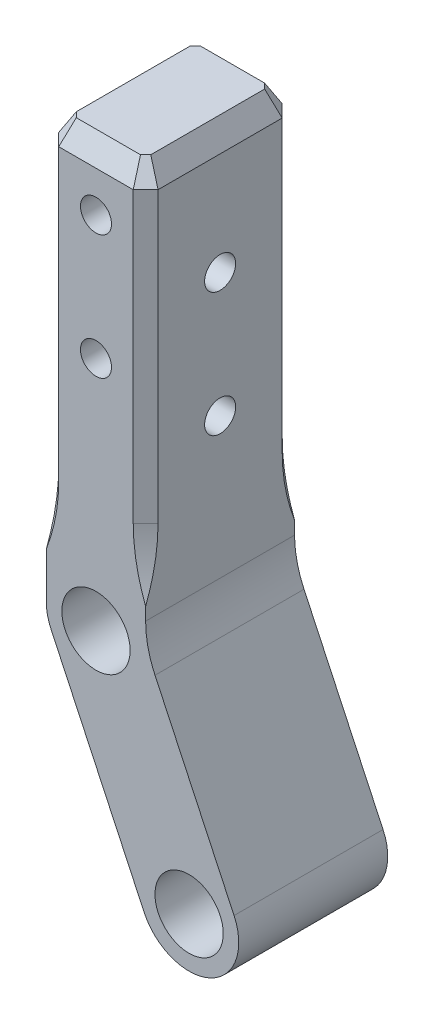
ISO-10303-21;
HEADER;
FILE_DESCRIPTION(('STEP AP214'),'2;1');
FILE_NAME('part.step','',(''),(''),'','','');
FILE_SCHEMA(('AUTOMOTIVE_DESIGN { 1 0 10303 214 1 1 1 1 }'));
ENDSEC;
DATA;
#1=APPLICATION_CONTEXT('core data for automotive mechanical design processes');
#2=APPLICATION_PROTOCOL_DEFINITION('international standard','automotive_design',2000,#1);
#3=PRODUCT_CONTEXT('',#1,'mechanical');
#4=PRODUCT('Part','Part','',(#3));
#5=PRODUCT_RELATED_PRODUCT_CATEGORY('part','',(#4));
#6=PRODUCT_DEFINITION_FORMATION('','',#4);
#7=PRODUCT_DEFINITION_CONTEXT('part definition',#1,'design');
#8=PRODUCT_DEFINITION('design','',#6,#7);
#9=PRODUCT_DEFINITION_SHAPE('','',#8);
#10=(LENGTH_UNIT() NAMED_UNIT(*) SI_UNIT(.MILLI.,.METRE.));
#11=(NAMED_UNIT(*) PLANE_ANGLE_UNIT() SI_UNIT($,.RADIAN.));
#12=(NAMED_UNIT(*) SI_UNIT($,.STERADIAN.) SOLID_ANGLE_UNIT());
#13=UNCERTAINTY_MEASURE_WITH_UNIT(LENGTH_MEASURE(1.E-05),#10,'distance_accuracy_value','');
#14=(GEOMETRIC_REPRESENTATION_CONTEXT(3) GLOBAL_UNCERTAINTY_ASSIGNED_CONTEXT((#13)) GLOBAL_UNIT_ASSIGNED_CONTEXT((#10,
#11,#12)) REPRESENTATION_CONTEXT('',''));
#15=CARTESIAN_POINT('',(0.,0.,0.));
#16=DIRECTION('',(0.,0.,1.));
#17=DIRECTION('',(1.,0.,0.));
#18=AXIS2_PLACEMENT_3D('',#15,#16,#17);
#19=CARTESIAN_POINT('',(-4.,34.,6.));
#20=DIRECTION('',(0.,-1.,0.));
#21=DIRECTION('',(0.,0.,-1.));
#22=AXIS2_PLACEMENT_3D('',#19,#20,#21);
#23=PLANE('',#22);
#24=DIRECTION('',(-0.707106781186548,0.,0.707106781186548));
#25=VECTOR('',#24,1.);
#26=CARTESIAN_POINT('',(-3.29289321881345,34.,-4.29289321881345));
#27=LINE('',#26,#25);
#28=CARTESIAN_POINT('',(-2.5857864376269,34.,-5.));
#29=VERTEX_POINT('',#28);
#30=CARTESIAN_POINT('',(-3.,34.,-4.5857864376269));
#31=VERTEX_POINT('',#30);
#32=EDGE_CURVE('E371',#29,#31,#27,.T.);
#33=ORIENTED_EDGE('',*,*,#32,.T.);
#34=DIRECTION('',(0.,0.,1.));
#35=VECTOR('',#34,1.);
#36=CARTESIAN_POINT('',(-3.,34.,6.));
#37=LINE('',#36,#35);
#38=CARTESIAN_POINT('',(-3.,34.,4.58578643762691));
#39=VERTEX_POINT('',#38);
#40=EDGE_CURVE('E373',#31,#39,#37,.T.);
#41=ORIENTED_EDGE('',*,*,#40,.T.);
#42=DIRECTION('',(0.707106781186548,0.,0.707106781186548));
#43=VECTOR('',#42,1.);
#44=CARTESIAN_POINT('',(-2.29289321881345,34.,5.29289321881345));
#45=LINE('',#44,#43);
#46=CARTESIAN_POINT('',(-2.58578643762691,34.,5.));
#47=VERTEX_POINT('',#46);
#48=EDGE_CURVE('E359',#39,#47,#45,.T.);
#49=ORIENTED_EDGE('',*,*,#48,.T.);
#50=DIRECTION('',(1.,0.,0.));
#51=VECTOR('',#50,1.);
#52=CARTESIAN_POINT('',(3.,34.,5.));
#53=LINE('',#52,#51);
#54=CARTESIAN_POINT('',(2.5857864376269,34.,5.));
#55=VERTEX_POINT('',#54);
#56=EDGE_CURVE('E361',#47,#55,#53,.T.);
#57=ORIENTED_EDGE('',*,*,#56,.T.);
#58=DIRECTION('',(0.707106781186548,0.,-0.707106781186548));
#59=VECTOR('',#58,1.);
#60=CARTESIAN_POINT('',(3.29289321881345,34.,4.29289321881345));
#61=LINE('',#60,#59);
#62=CARTESIAN_POINT('',(3.,34.,4.58578643762691));
#63=VERTEX_POINT('',#62);
#64=EDGE_CURVE('E363',#55,#63,#61,.T.);
#65=ORIENTED_EDGE('',*,*,#64,.T.);
#66=DIRECTION('',(0.,0.,-1.));
#67=VECTOR('',#66,1.);
#68=CARTESIAN_POINT('',(3.,34.,6.));
#69=LINE('',#68,#67);
#70=CARTESIAN_POINT('',(3.,34.,-4.58578643762691));
#71=VERTEX_POINT('',#70);
#72=EDGE_CURVE('E365',#63,#71,#69,.T.);
#73=ORIENTED_EDGE('',*,*,#72,.T.);
#74=DIRECTION('',(-0.707106781186548,0.,-0.707106781186548));
#75=VECTOR('',#74,1.);
#76=CARTESIAN_POINT('',(2.29289321881345,34.,-5.29289321881345));
#77=LINE('',#76,#75);
#78=CARTESIAN_POINT('',(2.5857864376269,34.,-5.));
#79=VERTEX_POINT('',#78);
#80=EDGE_CURVE('E367',#71,#79,#77,.T.);
#81=ORIENTED_EDGE('',*,*,#80,.T.);
#82=DIRECTION('',(-1.,0.,0.));
#83=VECTOR('',#82,1.);
#84=CARTESIAN_POINT('',(-4.,34.,-5.));
#85=LINE('',#84,#83);
#86=EDGE_CURVE('E369',#79,#29,#85,.T.);
#87=ORIENTED_EDGE('',*,*,#86,.T.);
#88=EDGE_LOOP('',(#33,#41,#49,#57,#65,#73,#81,#87));
#89=FACE_BOUND('',#88,.T.);
#90=ADVANCED_FACE('F21',(#89),#23,.F.);
#91=CARTESIAN_POINT('',(7.5,-16.,6.));
#92=DIRECTION('',(0.,0.,1.));
#93=DIRECTION('',(1.,0.,0.));
#94=AXIS2_PLACEMENT_3D('',#91,#92,#93);
#95=PLANE('',#94);
#96=CARTESIAN_POINT('',(0.,29.,6.));
#97=DIRECTION('',(0.,0.,1.));
#98=DIRECTION('',(1.,0.,0.));
#99=AXIS2_PLACEMENT_3D('',#96,#97,#98);
#100=CIRCLE('',#99,1.25);
#101=CARTESIAN_POINT('',(1.25,29.,6.));
#102=VERTEX_POINT('',#101);
#103=EDGE_CURVE('E223',#102,#102,#100,.T.);
#104=ORIENTED_EDGE('',*,*,#103,.F.);
#105=EDGE_LOOP('',(#104));
#106=FACE_BOUND('',#105,.T.);
#107=CARTESIAN_POINT('',(0.,19.,6.));
#108=DIRECTION('',(0.,0.,1.));
#109=DIRECTION('',(1.,0.,0.));
#110=AXIS2_PLACEMENT_3D('',#107,#108,#109);
#111=CIRCLE('',#110,1.25);
#112=CARTESIAN_POINT('',(1.25,19.,6.));
#113=VERTEX_POINT('',#112);
#114=EDGE_CURVE('E229',#113,#113,#111,.T.);
#115=ORIENTED_EDGE('',*,*,#114,.F.);
#116=EDGE_LOOP('',(#115));
#117=FACE_BOUND('',#116,.T.);
#118=CARTESIAN_POINT('',(0.,0.,6.));
#119=DIRECTION('',(0.,0.,1.));
#120=DIRECTION('',(1.,0.,0.));
#121=AXIS2_PLACEMENT_3D('',#118,#119,#120);
#122=CIRCLE('',#121,2.75);
#123=CARTESIAN_POINT('',(2.75,0.,6.));
#124=VERTEX_POINT('',#123);
#125=EDGE_CURVE('E232',#124,#124,#122,.T.);
#126=ORIENTED_EDGE('',*,*,#125,.F.);
#127=EDGE_LOOP('',(#126));
#128=FACE_BOUND('',#127,.T.);
#129=CARTESIAN_POINT('',(7.5,-16.,6.));
#130=DIRECTION('',(0.,0.,1.));
#131=DIRECTION('',(1.,0.,0.));
#132=AXIS2_PLACEMENT_3D('',#129,#130,#131);
#133=CIRCLE('',#132,2.75);
#134=CARTESIAN_POINT('',(10.25,-16.,6.));
#135=VERTEX_POINT('',#134);
#136=EDGE_CURVE('E238',#135,#135,#133,.T.);
#137=ORIENTED_EDGE('',*,*,#136,.F.);
#138=EDGE_LOOP('',(#137));
#139=FACE_BOUND('',#138,.T.);
#140=DIRECTION('',(0.,-1.,0.));
#141=VECTOR('',#140,1.);
#142=CARTESIAN_POINT('',(3.,35.,6.));
#143=LINE('',#142,#141);
#144=CARTESIAN_POINT('',(3.,32.2679491924311,6.));
#145=VERTEX_POINT('',#144);
#146=CARTESIAN_POINT('',(3.,9.,6.));
#147=VERTEX_POINT('',#146);
#148=EDGE_CURVE('E173',#145,#147,#143,.T.);
#149=ORIENTED_EDGE('',*,*,#148,.F.);
#150=DIRECTION('',(-1.,0.,0.));
#151=VECTOR('',#150,1.);
#152=CARTESIAN_POINT('',(-3.,32.2679491924311,6.));
#153=LINE('',#152,#151);
#154=CARTESIAN_POINT('',(-3.,32.2679491924311,6.));
#155=VERTEX_POINT('',#154);
#156=EDGE_CURVE('E30',#145,#155,#153,.T.);
#157=ORIENTED_EDGE('',*,*,#156,.T.);
#158=DIRECTION('',(0.,-1.,0.));
#159=VECTOR('',#158,1.);
#160=CARTESIAN_POINT('',(-3.,35.,6.));
#161=LINE('',#160,#159);
#162=CARTESIAN_POINT('',(-3.,9.,6.));
#163=VERTEX_POINT('',#162);
#164=EDGE_CURVE('E157',#155,#163,#161,.T.);
#165=ORIENTED_EDGE('',*,*,#164,.T.);
#166=CARTESIAN_POINT('',(-31.5,9.,6.));
#167=DIRECTION('',(0.,0.,1.));
#168=DIRECTION('',(-1.,0.,0.));
#169=AXIS2_PLACEMENT_3D('',#166,#167,#168);
#170=ELLIPSE('',#169,28.5,20.1525432638166);
#171=CARTESIAN_POINT('',(-4.,3.70849737787082,6.));
#172=VERTEX_POINT('',#171);
#173=EDGE_CURVE('E160',#163,#172,#170,.F.);
#174=ORIENTED_EDGE('',*,*,#173,.T.);
#175=DIRECTION('',(0.,-1.,0.));
#176=VECTOR('',#175,1.);
#177=CARTESIAN_POINT('',(-4.,0.,6.));
#178=LINE('',#177,#176);
#179=CARTESIAN_POINT('',(-4.,0.,6.));
#180=VERTEX_POINT('',#179);
#181=EDGE_CURVE('E247',#172,#180,#178,.T.);
#182=ORIENTED_EDGE('',*,*,#181,.T.);
#183=CARTESIAN_POINT('',(0.,0.,6.));
#184=DIRECTION('',(0.,0.,1.));
#185=DIRECTION('',(1.,0.,0.));
#186=AXIS2_PLACEMENT_3D('',#183,#184,#185);
#187=CIRCLE('',#186,4.);
#188=CARTESIAN_POINT('',(-3.62183574383547,-1.69773550492288,6.));
#189=VERTEX_POINT('',#188);
#190=EDGE_CURVE('E433',#180,#189,#187,.T.);
#191=ORIENTED_EDGE('',*,*,#190,.T.);
#192=DIRECTION('',(0.42443387623072,-0.905458935958868,0.));
#193=VECTOR('',#192,1.);
#194=CARTESIAN_POINT('',(-3.62183574383547,-1.69773550492288,6.));
#195=LINE('',#194,#193);
#196=CARTESIAN_POINT('',(3.87816425616453,-17.6977355049229,6.));
#197=VERTEX_POINT('',#196);
#198=EDGE_CURVE('E434',#189,#197,#195,.T.);
#199=ORIENTED_EDGE('',*,*,#198,.T.);
#200=CARTESIAN_POINT('',(7.5,-16.,6.));
#201=DIRECTION('',(0.,0.,1.));
#202=DIRECTION('',(1.,0.,0.));
#203=AXIS2_PLACEMENT_3D('',#200,#201,#202);
#204=CIRCLE('',#203,4.);
#205=CARTESIAN_POINT('',(11.1218357438355,-14.3022644950771,6.));
#206=VERTEX_POINT('',#205);
#207=EDGE_CURVE('E436',#197,#206,#204,.T.);
#208=ORIENTED_EDGE('',*,*,#207,.T.);
#209=DIRECTION('',(-0.42443387623072,0.905458935958868,0.));
#210=VECTOR('',#209,1.);
#211=CARTESIAN_POINT('',(4.,0.890985091771893,6.));
#212=LINE('',#211,#210);
#213=CARTESIAN_POINT('',(4.75632851232905,-0.722515734530082,6.));
#214=VERTEX_POINT('',#213);
#215=EDGE_CURVE('E440',#206,#214,#212,.T.);
#216=ORIENTED_EDGE('',*,*,#215,.T.);
#217=CARTESIAN_POINT('',(4.,2.67295527531568,6.));
#218=CARTESIAN_POINT('',(4.,0.890985091771898,6.));
#219=CARTESIAN_POINT('',(4.75632851232905,-0.722515734530081,6.));
#220=(BOUNDED_CURVE() B_SPLINE_CURVE(2,(#217,#218,#219),.UNSPECIFIED.,.F.,
.F.) B_SPLINE_CURVE_WITH_KNOTS((3,3),(0.,1.),
.UNSPECIFIED.) CURVE() GEOMETRIC_REPRESENTATION_ITEM() RATIONAL_B_SPLINE_CURVE((1.,1.,1.)) REPRESENTATION_ITEM(''));
#221=CARTESIAN_POINT('',(4.,2.67295527531568,6.));
#222=VERTEX_POINT('',#221);
#223=EDGE_CURVE('E350',#214,#222,#220,.F.);
#224=ORIENTED_EDGE('',*,*,#223,.T.);
#225=DIRECTION('',(0.,1.,0.));
#226=VECTOR('',#225,1.);
#227=CARTESIAN_POINT('',(4.,34.,6.));
#228=LINE('',#227,#226);
#229=CARTESIAN_POINT('',(4.,3.70849737787083,6.));
#230=VERTEX_POINT('',#229);
#231=EDGE_CURVE('E250',#222,#230,#228,.T.);
#232=ORIENTED_EDGE('',*,*,#231,.T.);
#233=CARTESIAN_POINT('',(31.5,9.,6.));
#234=DIRECTION('',(0.,0.,1.));
#235=DIRECTION('',(-1.,0.,0.));
#236=AXIS2_PLACEMENT_3D('',#233,#234,#235);
#237=ELLIPSE('',#236,28.5,20.1525432638166);
#238=EDGE_CURVE('E352',#230,#147,#237,.F.);
#239=ORIENTED_EDGE('',*,*,#238,.T.);
#240=EDGE_LOOP('',(#149,#157,#165,#174,#182,#191,#199,#208,#216,#224,#232,#239));
#241=FACE_BOUND('',#240,.T.);
#242=ADVANCED_FACE('F159',(#106,#117,#128,#139,#241),#95,.T.);
#243=CARTESIAN_POINT('',(-4.,0.,6.));
#244=DIRECTION('',(1.,0.,0.));
#245=DIRECTION('',(0.,0.,-1.));
#246=AXIS2_PLACEMENT_3D('',#243,#244,#245);
#247=PLANE('',#246);
#248=CARTESIAN_POINT('',(-4.,14.,0.));
#249=DIRECTION('',(-1.,0.,0.));
#250=DIRECTION('',(0.,0.,1.));
#251=AXIS2_PLACEMENT_3D('',#248,#249,#250);
#252=CIRCLE('',#251,1.24999999999999);
#253=CARTESIAN_POINT('',(-4.,14.,1.24999999999999));
#254=VERTEX_POINT('',#253);
#255=EDGE_CURVE('E214',#254,#254,#252,.T.);
#256=ORIENTED_EDGE('',*,*,#255,.F.);
#257=EDGE_LOOP('',(#256));
#258=FACE_BOUND('',#257,.T.);
#259=CARTESIAN_POINT('',(-4.,24.,0.));
#260=DIRECTION('',(-1.,0.,0.));
#261=DIRECTION('',(0.,0.,1.));
#262=AXIS2_PLACEMENT_3D('',#259,#260,#261);
#263=CIRCLE('',#262,1.24999999999999);
#264=CARTESIAN_POINT('',(-4.,24.,1.24999999999999));
#265=VERTEX_POINT('',#264);
#266=EDGE_CURVE('E208',#265,#265,#263,.T.);
#267=ORIENTED_EDGE('',*,*,#266,.F.);
#268=EDGE_LOOP('',(#267));
#269=FACE_BOUND('',#268,.T.);
#270=DIRECTION('',(0.,-1.,0.));
#271=VECTOR('',#270,1.);
#272=CARTESIAN_POINT('',(-4.,35.,5.));
#273=LINE('',#272,#271);
#274=CARTESIAN_POINT('',(-4.,32.2679491924311,5.));
#275=VERTEX_POINT('',#274);
#276=CARTESIAN_POINT('',(-4.,9.,5.));
#277=VERTEX_POINT('',#276);
#278=EDGE_CURVE('E166',#275,#277,#273,.T.);
#279=ORIENTED_EDGE('',*,*,#278,.F.);
#280=DIRECTION('',(0.,0.,-1.));
#281=VECTOR('',#280,1.);
#282=CARTESIAN_POINT('',(-4.,32.2679491924311,6.));
#283=LINE('',#282,#281);
#284=CARTESIAN_POINT('',(-4.,32.2679491924311,-5.));
#285=VERTEX_POINT('',#284);
#286=EDGE_CURVE('E356',#275,#285,#283,.T.);
#287=ORIENTED_EDGE('',*,*,#286,.T.);
#288=DIRECTION('',(0.,-1.,0.));
#289=VECTOR('',#288,1.);
#290=CARTESIAN_POINT('',(-4.,35.,-5.));
#291=LINE('',#290,#289);
#292=CARTESIAN_POINT('',(-4.,9.,-5.));
#293=VERTEX_POINT('',#292);
#294=EDGE_CURVE('E201',#285,#293,#291,.T.);
#295=ORIENTED_EDGE('',*,*,#294,.T.);
#296=CARTESIAN_POINT('',(-4.,9.,-33.5));
#297=DIRECTION('',(1.,0.,0.));
#298=DIRECTION('',(0.,0.,-1.));
#299=AXIS2_PLACEMENT_3D('',#296,#297,#298);
#300=ELLIPSE('',#299,28.5,20.1525432638166);
#301=CARTESIAN_POINT('',(-4.,3.70849737787082,-6.));
#302=VERTEX_POINT('',#301);
#303=EDGE_CURVE('E341',#302,#293,#300,.F.);
#304=ORIENTED_EDGE('',*,*,#303,.F.);
#305=DIRECTION('',(0.,-1.,0.));
#306=VECTOR('',#305,1.);
#307=CARTESIAN_POINT('',(-4.,0.,-6.));
#308=LINE('',#307,#306);
#309=CARTESIAN_POINT('',(-4.,0.,-6.));
#310=VERTEX_POINT('',#309);
#311=EDGE_CURVE('E774',#302,#310,#308,.T.);
#312=ORIENTED_EDGE('',*,*,#311,.T.);
#313=DIRECTION('',(0.,0.,-1.));
#314=VECTOR('',#313,1.);
#315=CARTESIAN_POINT('',(-4.,0.,6.));
#316=LINE('',#315,#314);
#317=EDGE_CURVE('E431',#180,#310,#316,.T.);
#318=ORIENTED_EDGE('',*,*,#317,.F.);
#319=ORIENTED_EDGE('',*,*,#181,.F.);
#320=CARTESIAN_POINT('',(-4.,9.,33.5));
#321=DIRECTION('',(1.,0.,0.));
#322=DIRECTION('',(0.,0.,-1.));
#323=AXIS2_PLACEMENT_3D('',#320,#321,#322);
#324=ELLIPSE('',#323,28.5,20.1525432638166);
#325=EDGE_CURVE('E172',#277,#172,#324,.F.);
#326=ORIENTED_EDGE('',*,*,#325,.F.);
#327=EDGE_LOOP('',(#279,#287,#295,#304,#312,#318,#319,#326));
#328=FACE_BOUND('',#327,.T.);
#329=ADVANCED_FACE('F281',(#258,#269,#328),#247,.F.);
#330=CARTESIAN_POINT('',(4.,34.,6.));
#331=DIRECTION('',(-1.,0.,0.));
#332=DIRECTION('',(0.,-1.,0.));
#333=AXIS2_PLACEMENT_3D('',#330,#331,#332);
#334=PLANE('',#333);
#335=CARTESIAN_POINT('',(4.,14.,0.));
#336=DIRECTION('',(-1.,0.,0.));
#337=DIRECTION('',(0.,-1.,0.));
#338=AXIS2_PLACEMENT_3D('',#335,#336,#337);
#339=CIRCLE('',#338,1.24999999999999);
#340=CARTESIAN_POINT('',(4.,12.75,0.));
#341=VERTEX_POINT('',#340);
#342=EDGE_CURVE('E217',#341,#341,#339,.T.);
#343=ORIENTED_EDGE('',*,*,#342,.T.);
#344=EDGE_LOOP('',(#343));
#345=FACE_BOUND('',#344,.T.);
#346=CARTESIAN_POINT('',(4.,24.,0.));
#347=DIRECTION('',(-1.,0.,0.));
#348=DIRECTION('',(0.,-1.,0.));
#349=AXIS2_PLACEMENT_3D('',#346,#347,#348);
#350=CIRCLE('',#349,1.24999999999999);
#351=CARTESIAN_POINT('',(4.,22.75,0.));
#352=VERTEX_POINT('',#351);
#353=EDGE_CURVE('E211',#352,#352,#350,.T.);
#354=ORIENTED_EDGE('',*,*,#353,.T.);
#355=EDGE_LOOP('',(#354));
#356=FACE_BOUND('',#355,.T.);
#357=DIRECTION('',(0.,-1.,0.));
#358=VECTOR('',#357,1.);
#359=CARTESIAN_POINT('',(4.,35.,-5.));
#360=LINE('',#359,#358);
#361=CARTESIAN_POINT('',(4.,32.2679491924311,-5.));
#362=VERTEX_POINT('',#361);
#363=CARTESIAN_POINT('',(4.,9.,-5.));
#364=VERTEX_POINT('',#363);
#365=EDGE_CURVE('E189',#362,#364,#360,.T.);
#366=ORIENTED_EDGE('',*,*,#365,.F.);
#367=DIRECTION('',(0.,0.,1.));
#368=VECTOR('',#367,1.);
#369=CARTESIAN_POINT('',(4.,32.2679491924311,6.));
#370=LINE('',#369,#368);
#371=CARTESIAN_POINT('',(4.,32.2679491924311,5.));
#372=VERTEX_POINT('',#371);
#373=EDGE_CURVE('E382',#362,#372,#370,.T.);
#374=ORIENTED_EDGE('',*,*,#373,.T.);
#375=DIRECTION('',(0.,-1.,0.));
#376=VECTOR('',#375,1.);
#377=CARTESIAN_POINT('',(4.,35.,5.));
#378=LINE('',#377,#376);
#379=CARTESIAN_POINT('',(4.,9.,5.));
#380=VERTEX_POINT('',#379);
#381=EDGE_CURVE('E181',#372,#380,#378,.T.);
#382=ORIENTED_EDGE('',*,*,#381,.T.);
#383=CARTESIAN_POINT('',(4.,9.,33.5));
#384=DIRECTION('',(-1.,0.,0.));
#385=DIRECTION('',(0.,0.,1.));
#386=AXIS2_PLACEMENT_3D('',#383,#384,#385);
#387=ELLIPSE('',#386,28.5,20.1525432638166);
#388=EDGE_CURVE('E186',#230,#380,#387,.F.);
#389=ORIENTED_EDGE('',*,*,#388,.F.);
#390=ORIENTED_EDGE('',*,*,#231,.F.);
#391=CARTESIAN_POINT('',(4.,2.67295527531568,-6.6));
#392=CARTESIAN_POINT('',(4.,2.67295527531568,-2.2));
#393=CARTESIAN_POINT('',(4.,2.67295527531568,2.2));
#394=CARTESIAN_POINT('',(4.,2.67295527531568,6.6));
#395=(BOUNDED_CURVE() B_SPLINE_CURVE(3,(#391,#392,#393,#394),.UNSPECIFIED.,.F.,
.F.) B_SPLINE_CURVE_WITH_KNOTS((4,4),(-0.0126,0.0006),
.UNSPECIFIED.) CURVE() GEOMETRIC_REPRESENTATION_ITEM() RATIONAL_B_SPLINE_CURVE((1.,1.,1.,1.)) REPRESENTATION_ITEM(''));
#396=CARTESIAN_POINT('',(4.,2.67295527531568,-6.));
#397=VERTEX_POINT('',#396);
#398=EDGE_CURVE('E263',#222,#397,#395,.F.);
#399=ORIENTED_EDGE('',*,*,#398,.T.);
#400=DIRECTION('',(0.,1.,0.));
#401=VECTOR('',#400,1.);
#402=CARTESIAN_POINT('',(4.,34.,-6.));
#403=LINE('',#402,#401);
#404=CARTESIAN_POINT('',(4.,3.70849737787082,-6.));
#405=VERTEX_POINT('',#404);
#406=EDGE_CURVE('E244',#397,#405,#403,.T.);
#407=ORIENTED_EDGE('',*,*,#406,.T.);
#408=CARTESIAN_POINT('',(4.,9.,-33.5));
#409=DIRECTION('',(-1.,0.,0.));
#410=DIRECTION('',(0.,0.,1.));
#411=AXIS2_PLACEMENT_3D('',#408,#409,#410);
#412=ELLIPSE('',#411,28.5,20.1525432638166);
#413=EDGE_CURVE('E349',#364,#405,#412,.F.);
#414=ORIENTED_EDGE('',*,*,#413,.F.);
#415=EDGE_LOOP('',(#366,#374,#382,#389,#390,#399,#407,#414));
#416=FACE_BOUND('',#415,.T.);
#417=ADVANCED_FACE('F271',(#345,#356,#416),#334,.F.);
#418=CARTESIAN_POINT('',(7.5,-16.,-6.));
#419=DIRECTION('',(0.,0.,1.));
#420=DIRECTION('',(1.,0.,0.));
#421=AXIS2_PLACEMENT_3D('',#418,#419,#420);
#422=PLANE('',#421);
#423=CARTESIAN_POINT('',(0.,19.,-6.));
#424=DIRECTION('',(0.,0.,-1.));
#425=DIRECTION('',(-1.,0.,0.));
#426=AXIS2_PLACEMENT_3D('',#423,#424,#425);
#427=CIRCLE('',#426,1.25);
#428=CARTESIAN_POINT('',(-1.25,19.,-6.));
#429=VERTEX_POINT('',#428);
#430=EDGE_CURVE('E226',#429,#429,#427,.T.);
#431=ORIENTED_EDGE('',*,*,#430,.F.);
#432=EDGE_LOOP('',(#431));
#433=FACE_BOUND('',#432,.T.);
#434=CARTESIAN_POINT('',(7.5,-16.,-6.));
#435=DIRECTION('',(0.,0.,1.));
#436=DIRECTION('',(1.,0.,0.));
#437=AXIS2_PLACEMENT_3D('',#434,#435,#436);
#438=CIRCLE('',#437,2.75);
#439=CARTESIAN_POINT('',(10.25,-16.,-6.));
#440=VERTEX_POINT('',#439);
#441=EDGE_CURVE('E241',#440,#440,#438,.T.);
#442=ORIENTED_EDGE('',*,*,#441,.T.);
#443=EDGE_LOOP('',(#442));
#444=FACE_BOUND('',#443,.T.);
#445=CARTESIAN_POINT('',(0.,0.,-6.));
#446=DIRECTION('',(0.,0.,1.));
#447=DIRECTION('',(1.,0.,0.));
#448=AXIS2_PLACEMENT_3D('',#445,#446,#447);
#449=CIRCLE('',#448,2.75);
#450=CARTESIAN_POINT('',(2.75,0.,-6.));
#451=VERTEX_POINT('',#450);
#452=EDGE_CURVE('E235',#451,#451,#449,.T.);
#453=ORIENTED_EDGE('',*,*,#452,.T.);
#454=EDGE_LOOP('',(#453));
#455=FACE_BOUND('',#454,.T.);
#456=CARTESIAN_POINT('',(0.,29.,-6.));
#457=DIRECTION('',(0.,0.,-1.));
#458=DIRECTION('',(-1.,0.,0.));
#459=AXIS2_PLACEMENT_3D('',#456,#457,#458);
#460=CIRCLE('',#459,1.25);
#461=CARTESIAN_POINT('',(-1.25,29.,-6.));
#462=VERTEX_POINT('',#461);
#463=EDGE_CURVE('E220',#462,#462,#460,.T.);
#464=ORIENTED_EDGE('',*,*,#463,.F.);
#465=EDGE_LOOP('',(#464));
#466=FACE_BOUND('',#465,.T.);
#467=DIRECTION('',(0.,-1.,0.));
#468=VECTOR('',#467,1.);
#469=CARTESIAN_POINT('',(-3.,35.,-6.));
#470=LINE('',#469,#468);
#471=CARTESIAN_POINT('',(-3.,32.2679491924311,-6.));
#472=VERTEX_POINT('',#471);
#473=CARTESIAN_POINT('',(-3.,9.,-6.));
#474=VERTEX_POINT('',#473);
#475=EDGE_CURVE('E199',#472,#474,#470,.T.);
#476=ORIENTED_EDGE('',*,*,#475,.F.);
#477=DIRECTION('',(1.,0.,0.));
#478=VECTOR('',#477,1.);
#479=CARTESIAN_POINT('',(7.5,32.2679491924311,-6.));
#480=LINE('',#479,#478);
#481=CARTESIAN_POINT('',(3.,32.2679491924311,-6.));
#482=VERTEX_POINT('',#481);
#483=EDGE_CURVE('E378',#472,#482,#480,.T.);
#484=ORIENTED_EDGE('',*,*,#483,.T.);
#485=DIRECTION('',(0.,-1.,0.));
#486=VECTOR('',#485,1.);
#487=CARTESIAN_POINT('',(3.,35.,-6.));
#488=LINE('',#487,#486);
#489=CARTESIAN_POINT('',(3.,9.,-6.));
#490=VERTEX_POINT('',#489);
#491=EDGE_CURVE('E191',#482,#490,#488,.T.);
#492=ORIENTED_EDGE('',*,*,#491,.T.);
#493=CARTESIAN_POINT('',(31.5,9.,-6.));
#494=DIRECTION('',(0.,0.,1.));
#495=DIRECTION('',(1.,0.,0.));
#496=AXIS2_PLACEMENT_3D('',#493,#494,#495);
#497=ELLIPSE('',#496,28.5,20.1525432638166);
#498=EDGE_CURVE('E196',#405,#490,#497,.F.);
#499=ORIENTED_EDGE('',*,*,#498,.F.);
#500=ORIENTED_EDGE('',*,*,#406,.F.);
#501=CARTESIAN_POINT('',(4.75632851232905,-0.722515734530081,-6.));
#502=CARTESIAN_POINT('',(4.,0.890985091771898,-6.));
#503=CARTESIAN_POINT('',(4.,2.67295527531568,-6.));
#504=(BOUNDED_CURVE() B_SPLINE_CURVE(2,(#501,#502,#503),.UNSPECIFIED.,.F.,
.F.) B_SPLINE_CURVE_WITH_KNOTS((3,3),(0.,1.),
.UNSPECIFIED.) CURVE() GEOMETRIC_REPRESENTATION_ITEM() RATIONAL_B_SPLINE_CURVE((1.,1.,1.)) REPRESENTATION_ITEM(''));
#505=CARTESIAN_POINT('',(4.75632851232905,-0.722515734530082,-6.));
#506=VERTEX_POINT('',#505);
#507=EDGE_CURVE('E773',#397,#506,#504,.F.);
#508=ORIENTED_EDGE('',*,*,#507,.T.);
#509=DIRECTION('',(-0.42443387623072,0.905458935958868,0.));
#510=VECTOR('',#509,1.);
#511=CARTESIAN_POINT('',(4.,0.890985091771893,-6.));
#512=LINE('',#511,#510);
#513=CARTESIAN_POINT('',(11.1218357438355,-14.3022644950771,-6.));
#514=VERTEX_POINT('',#513);
#515=EDGE_CURVE('E254',#514,#506,#512,.T.);
#516=ORIENTED_EDGE('',*,*,#515,.F.);
#517=CARTESIAN_POINT('',(7.5,-16.,-6.));
#518=DIRECTION('',(0.,0.,1.));
#519=DIRECTION('',(1.,0.,0.));
#520=AXIS2_PLACEMENT_3D('',#517,#518,#519);
#521=CIRCLE('',#520,4.);
#522=CARTESIAN_POINT('',(3.87816425616453,-17.6977355049229,-6.));
#523=VERTEX_POINT('',#522);
#524=EDGE_CURVE('E781',#523,#514,#521,.T.);
#525=ORIENTED_EDGE('',*,*,#524,.F.);
#526=DIRECTION('',(0.42443387623072,-0.905458935958868,0.));
#527=VECTOR('',#526,1.);
#528=CARTESIAN_POINT('',(-3.62183574383547,-1.69773550492288,-6.));
#529=LINE('',#528,#527);
#530=CARTESIAN_POINT('',(-3.62183574383547,-1.69773550492288,-6.));
#531=VERTEX_POINT('',#530);
#532=EDGE_CURVE('E777',#531,#523,#529,.T.);
#533=ORIENTED_EDGE('',*,*,#532,.F.);
#534=CARTESIAN_POINT('',(0.,0.,-6.));
#535=DIRECTION('',(0.,0.,1.));
#536=DIRECTION('',(1.,0.,0.));
#537=AXIS2_PLACEMENT_3D('',#534,#535,#536);
#538=CIRCLE('',#537,4.);
#539=EDGE_CURVE('E775',#310,#531,#538,.T.);
#540=ORIENTED_EDGE('',*,*,#539,.F.);
#541=ORIENTED_EDGE('',*,*,#311,.F.);
#542=CARTESIAN_POINT('',(-31.5,9.,-6.));
#543=DIRECTION('',(0.,0.,1.));
#544=DIRECTION('',(1.,0.,0.));
#545=AXIS2_PLACEMENT_3D('',#542,#543,#544);
#546=ELLIPSE('',#545,28.5,20.1525432638166);
#547=EDGE_CURVE('E206',#474,#302,#546,.F.);
#548=ORIENTED_EDGE('',*,*,#547,.F.);
#549=EDGE_LOOP('',(#476,#484,#492,#499,#500,#508,#516,#525,#533,#540,#541,#548));
#550=FACE_BOUND('',#549,.T.);
#551=ADVANCED_FACE('F280',(#433,#444,#455,#466,#550),#422,.F.);
#552=CARTESIAN_POINT('',(0.,0.,6.));
#553=DIRECTION('',(0.,0.,-1.));
#554=DIRECTION('',(-1.,0.,0.));
#555=AXIS2_PLACEMENT_3D('',#552,#553,#554);
#556=CYLINDRICAL_SURFACE('',#555,4.);
#557=ORIENTED_EDGE('',*,*,#539,.T.);
#558=DIRECTION('',(0.,0.,-1.));
#559=VECTOR('',#558,1.);
#560=CARTESIAN_POINT('',(-3.62183574383547,-1.69773550492288,6.));
#561=LINE('',#560,#559);
#562=EDGE_CURVE('E789',#189,#531,#561,.T.);
#563=ORIENTED_EDGE('',*,*,#562,.F.);
#564=ORIENTED_EDGE('',*,*,#190,.F.);
#565=ORIENTED_EDGE('',*,*,#317,.T.);
#566=EDGE_LOOP('',(#557,#563,#564,#565));
#567=FACE_BOUND('',#566,.T.);
#568=ADVANCED_FACE('F477',(#567),#556,.T.);
#569=CARTESIAN_POINT('',(-3.62183574383547,-1.69773550492288,6.));
#570=DIRECTION('',(0.905458935958868,0.42443387623072,0.));
#571=DIRECTION('',(-0.42443387623072,0.905458935958869,0.));
#572=AXIS2_PLACEMENT_3D('',#569,#570,#571);
#573=PLANE('',#572);
#574=ORIENTED_EDGE('',*,*,#532,.T.);
#575=DIRECTION('',(0.,0.,-1.));
#576=VECTOR('',#575,1.);
#577=CARTESIAN_POINT('',(3.87816425616453,-17.6977355049229,6.));
#578=LINE('',#577,#576);
#579=EDGE_CURVE('E786',#197,#523,#578,.T.);
#580=ORIENTED_EDGE('',*,*,#579,.F.);
#581=ORIENTED_EDGE('',*,*,#198,.F.);
#582=ORIENTED_EDGE('',*,*,#562,.T.);
#583=EDGE_LOOP('',(#574,#580,#581,#582));
#584=FACE_BOUND('',#583,.T.);
#585=ADVANCED_FACE('F473',(#584),#573,.F.);
#586=CARTESIAN_POINT('',(7.5,-16.,6.));
#587=DIRECTION('',(0.,0.,-1.));
#588=DIRECTION('',(-1.,0.,0.));
#589=AXIS2_PLACEMENT_3D('',#586,#587,#588);
#590=CYLINDRICAL_SURFACE('',#589,4.);
#591=ORIENTED_EDGE('',*,*,#524,.T.);
#592=DIRECTION('',(0.,0.,-1.));
#593=VECTOR('',#592,1.);
#594=CARTESIAN_POINT('',(11.1218357438355,-14.3022644950771,6.));
#595=LINE('',#594,#593);
#596=EDGE_CURVE('E446',#206,#514,#595,.T.);
#597=ORIENTED_EDGE('',*,*,#596,.F.);
#598=ORIENTED_EDGE('',*,*,#207,.F.);
#599=ORIENTED_EDGE('',*,*,#579,.T.);
#600=EDGE_LOOP('',(#591,#597,#598,#599));
#601=FACE_BOUND('',#600,.T.);
#602=ADVANCED_FACE('F468',(#601),#590,.T.);
#603=CARTESIAN_POINT('',(4.,0.890985091771893,6.));
#604=DIRECTION('',(-0.905458935958868,-0.42443387623072,0.));
#605=DIRECTION('',(0.42443387623072,-0.905458935958868,0.));
#606=AXIS2_PLACEMENT_3D('',#603,#604,#605);
#607=PLANE('',#606);
#608=ORIENTED_EDGE('',*,*,#515,.T.);
#609=CARTESIAN_POINT('',(4.75632851232905,-0.722515734530081,6.6));
#610=CARTESIAN_POINT('',(4.75632851232905,-0.722515734530081,2.2));
#611=CARTESIAN_POINT('',(4.75632851232905,-0.722515734530081,-2.2));
#612=CARTESIAN_POINT('',(4.75632851232905,-0.722515734530081,-6.6));
#613=(BOUNDED_CURVE() B_SPLINE_CURVE(3,(#609,#610,#611,#612),.UNSPECIFIED.,.F.,
.F.) B_SPLINE_CURVE_WITH_KNOTS((4,4),(-0.0126,0.0006),
.UNSPECIFIED.) CURVE() GEOMETRIC_REPRESENTATION_ITEM() RATIONAL_B_SPLINE_CURVE((1.,1.,1.,1.)) REPRESENTATION_ITEM(''));
#614=EDGE_CURVE('E451',#506,#214,#613,.F.);
#615=ORIENTED_EDGE('',*,*,#614,.T.);
#616=ORIENTED_EDGE('',*,*,#215,.F.);
#617=ORIENTED_EDGE('',*,*,#596,.T.);
#618=EDGE_LOOP('',(#608,#615,#616,#617));
#619=FACE_BOUND('',#618,.T.);
#620=ADVANCED_FACE('F457',(#619),#607,.F.);
#621=CARTESIAN_POINT('',(7.5,-16.,6.));
#622=DIRECTION('',(0.,0.,1.));
#623=DIRECTION('',(1.,0.,0.));
#624=AXIS2_PLACEMENT_3D('',#621,#622,#623);
#625=CYLINDRICAL_SURFACE('',#624,2.75);
#626=ORIENTED_EDGE('',*,*,#441,.F.);
#627=EDGE_LOOP('',(#626));
#628=FACE_BOUND('',#627,.T.);
#629=ORIENTED_EDGE('',*,*,#136,.T.);
#630=EDGE_LOOP('',(#629));
#631=FACE_BOUND('',#630,.T.);
#632=ADVANCED_FACE('F467',(#628,#631),#625,.F.);
#633=CARTESIAN_POINT('',(0.,0.,6.));
#634=DIRECTION('',(0.,0.,1.));
#635=DIRECTION('',(1.,0.,0.));
#636=AXIS2_PLACEMENT_3D('',#633,#634,#635);
#637=CYLINDRICAL_SURFACE('',#636,2.75);
#638=ORIENTED_EDGE('',*,*,#452,.F.);
#639=EDGE_LOOP('',(#638));
#640=FACE_BOUND('',#639,.T.);
#641=ORIENTED_EDGE('',*,*,#125,.T.);
#642=EDGE_LOOP('',(#641));
#643=FACE_BOUND('',#642,.T.);
#644=ADVANCED_FACE('F295',(#640,#643),#637,.F.);
#645=CARTESIAN_POINT('',(4.75632851232905,-0.722515734530081,-6.6));
#646=CARTESIAN_POINT('',(4.75632851232905,-0.722515734530081,-2.2));
#647=CARTESIAN_POINT('',(4.75632851232905,-0.722515734530081,2.2));
#648=CARTESIAN_POINT('',(4.75632851232905,-0.722515734530081,6.6));
#649=CARTESIAN_POINT('',(4.,0.890985091771898,-6.6));
#650=CARTESIAN_POINT('',(4.,0.890985091771898,-2.19999999999999));
#651=CARTESIAN_POINT('',(4.,0.890985091771898,2.2));
#652=CARTESIAN_POINT('',(4.,0.890985091771898,6.6));
#653=CARTESIAN_POINT('',(4.,2.67295527531568,-6.6));
#654=CARTESIAN_POINT('',(4.,2.67295527531568,-2.2));
#655=CARTESIAN_POINT('',(4.,2.67295527531568,2.2));
#656=CARTESIAN_POINT('',(4.,2.67295527531568,6.6));
#657=(BOUNDED_SURFACE() B_SPLINE_SURFACE(2,3,((#645,#646,#647,#648),(#649,#650,#651,#652),(#653,
#654,#655,#656)),.UNSPECIFIED.,.F.,.F.,.F.) B_SPLINE_SURFACE_WITH_KNOTS((3,3),(4,4),(0.,1.),
(-0.0126,0.0006),.UNSPECIFIED.) GEOMETRIC_REPRESENTATION_ITEM() RATIONAL_B_SPLINE_SURFACE(((1.,
1.,1.,1.),(1.,1.,1.,1.),(1.,1.,1.,1.))) REPRESENTATION_ITEM('') SURFACE());
#658=ORIENTED_EDGE('',*,*,#223,.F.);
#659=ORIENTED_EDGE('',*,*,#614,.F.);
#660=ORIENTED_EDGE('',*,*,#507,.F.);
#661=ORIENTED_EDGE('',*,*,#398,.F.);
#662=EDGE_LOOP('',(#658,#659,#660,#661));
#663=FACE_BOUND('',#662,.T.);
#664=ADVANCED_FACE('F285',(#663),#657,.T.);
#665=CARTESIAN_POINT('',(0.,19.,-6.));
#666=DIRECTION('',(0.,0.,-1.));
#667=DIRECTION('',(-1.,0.,0.));
#668=AXIS2_PLACEMENT_3D('',#665,#666,#667);
#669=CYLINDRICAL_SURFACE('',#668,1.25);
#670=ORIENTED_EDGE('',*,*,#430,.T.);
#671=EDGE_LOOP('',(#670));
#672=FACE_BOUND('',#671,.T.);
#673=ORIENTED_EDGE('',*,*,#114,.T.);
#674=EDGE_LOOP('',(#673));
#675=FACE_BOUND('',#674,.T.);
#676=ADVANCED_FACE('F294',(#672,#675),#669,.F.);
#677=CARTESIAN_POINT('',(0.,29.,-6.));
#678=DIRECTION('',(0.,0.,-1.));
#679=DIRECTION('',(-1.,0.,0.));
#680=AXIS2_PLACEMENT_3D('',#677,#678,#679);
#681=CYLINDRICAL_SURFACE('',#680,1.25);
#682=ORIENTED_EDGE('',*,*,#463,.T.);
#683=EDGE_LOOP('',(#682));
#684=FACE_BOUND('',#683,.T.);
#685=ORIENTED_EDGE('',*,*,#103,.T.);
#686=EDGE_LOOP('',(#685));
#687=FACE_BOUND('',#686,.T.);
#688=ADVANCED_FACE('F582',(#684,#687),#681,.F.);
#689=CARTESIAN_POINT('',(-4.,14.,0.));
#690=DIRECTION('',(-1.,0.,0.));
#691=DIRECTION('',(0.,0.,1.));
#692=AXIS2_PLACEMENT_3D('',#689,#690,#691);
#693=CYLINDRICAL_SURFACE('',#692,1.24999999999999);
#694=ORIENTED_EDGE('',*,*,#342,.F.);
#695=EDGE_LOOP('',(#694));
#696=FACE_BOUND('',#695,.T.);
#697=ORIENTED_EDGE('',*,*,#255,.T.);
#698=EDGE_LOOP('',(#697));
#699=FACE_BOUND('',#698,.T.);
#700=ADVANCED_FACE('F592',(#696,#699),#693,.F.);
#701=CARTESIAN_POINT('',(-4.,24.,0.));
#702=DIRECTION('',(-1.,0.,0.));
#703=DIRECTION('',(0.,0.,1.));
#704=AXIS2_PLACEMENT_3D('',#701,#702,#703);
#705=CYLINDRICAL_SURFACE('',#704,1.24999999999999);
#706=ORIENTED_EDGE('',*,*,#353,.F.);
#707=EDGE_LOOP('',(#706));
#708=FACE_BOUND('',#707,.T.);
#709=ORIENTED_EDGE('',*,*,#266,.T.);
#710=EDGE_LOOP('',(#709));
#711=FACE_BOUND('',#710,.T.);
#712=ADVANCED_FACE('F602',(#708,#711),#705,.F.);
#713=CARTESIAN_POINT('',(-17.75,9.,-19.75));
#714=DIRECTION('',(0.707106781186547,0.,-0.707106781186548));
#715=DIRECTION('',(-0.707106781186548,0.,-0.707106781186547));
#716=AXIS2_PLACEMENT_3D('',#713,#714,#715);
#717=CYLINDRICAL_SURFACE('',#716,20.1525432638166);
#718=ORIENTED_EDGE('',*,*,#547,.T.);
#719=ORIENTED_EDGE('',*,*,#303,.T.);
#720=DIRECTION('',(0.707106781186548,0.,-0.707106781186548));
#721=VECTOR('',#720,1.);
#722=CARTESIAN_POINT('',(-4.,9.,-5.));
#723=LINE('',#722,#721);
#724=EDGE_CURVE('E203',#293,#474,#723,.T.);
#725=ORIENTED_EDGE('',*,*,#724,.T.);
#726=EDGE_LOOP('',(#718,#719,#725));
#727=FACE_BOUND('',#726,.T.);
#728=ADVANCED_FACE('F612',(#727),#717,.F.);
#729=CARTESIAN_POINT('',(-4.,35.,-5.));
#730=DIRECTION('',(-0.707106781186548,0.,-0.707106781186548));
#731=DIRECTION('',(-0.707106781186548,0.,0.707106781186548));
#732=AXIS2_PLACEMENT_3D('',#729,#730,#731);
#733=PLANE('',#732);
#734=ORIENTED_EDGE('',*,*,#294,.F.);
#735=DIRECTION('',(0.707106781186548,0.,-0.707106781186548));
#736=VECTOR('',#735,1.);
#737=CARTESIAN_POINT('',(-3.,32.2679491924311,-6.));
#738=LINE('',#737,#736);
#739=EDGE_CURVE('E376',#285,#472,#738,.T.);
#740=ORIENTED_EDGE('',*,*,#739,.T.);
#741=ORIENTED_EDGE('',*,*,#475,.T.);
#742=ORIENTED_EDGE('',*,*,#724,.F.);
#743=EDGE_LOOP('',(#734,#740,#741,#742));
#744=FACE_BOUND('',#743,.T.);
#745=ADVANCED_FACE('F622',(#744),#733,.T.);
#746=CARTESIAN_POINT('',(17.75,9.,-19.75));
#747=DIRECTION('',(0.707106781186547,0.,0.707106781186548));
#748=DIRECTION('',(0.707106781186548,0.,-0.707106781186547));
#749=AXIS2_PLACEMENT_3D('',#746,#747,#748);
#750=CYLINDRICAL_SURFACE('',#749,20.1525432638166);
#751=ORIENTED_EDGE('',*,*,#498,.T.);
#752=DIRECTION('',(-0.707106781186548,0.,-0.707106781186548));
#753=VECTOR('',#752,1.);
#754=CARTESIAN_POINT('',(4.,9.,-5.));
#755=LINE('',#754,#753);
#756=EDGE_CURVE('E193',#490,#364,#755,.F.);
#757=ORIENTED_EDGE('',*,*,#756,.T.);
#758=ORIENTED_EDGE('',*,*,#413,.T.);
#759=EDGE_LOOP('',(#751,#757,#758));
#760=FACE_BOUND('',#759,.T.);
#761=ADVANCED_FACE('F631',(#760),#750,.F.);
#762=CARTESIAN_POINT('',(4.,35.,-5.));
#763=DIRECTION('',(0.707106781186548,0.,-0.707106781186548));
#764=DIRECTION('',(-0.707106781186548,0.,-0.707106781186548));
#765=AXIS2_PLACEMENT_3D('',#762,#763,#764);
#766=PLANE('',#765);
#767=ORIENTED_EDGE('',*,*,#491,.F.);
#768=DIRECTION('',(0.707106781186548,0.,0.707106781186548));
#769=VECTOR('',#768,1.);
#770=CARTESIAN_POINT('',(4.,32.2679491924311,-5.));
#771=LINE('',#770,#769);
#772=EDGE_CURVE('E380',#482,#362,#771,.T.);
#773=ORIENTED_EDGE('',*,*,#772,.T.);
#774=ORIENTED_EDGE('',*,*,#365,.T.);
#775=ORIENTED_EDGE('',*,*,#756,.F.);
#776=EDGE_LOOP('',(#767,#773,#774,#775));
#777=FACE_BOUND('',#776,.T.);
#778=ADVANCED_FACE('F640',(#777),#766,.T.);
#779=CARTESIAN_POINT('',(17.75,9.,19.75));
#780=DIRECTION('',(-0.707106781186547,0.,0.707106781186548));
#781=DIRECTION('',(0.707106781186548,0.,0.707106781186547));
#782=AXIS2_PLACEMENT_3D('',#779,#780,#781);
#783=CYLINDRICAL_SURFACE('',#782,20.1525432638166);
#784=ORIENTED_EDGE('',*,*,#388,.T.);
#785=DIRECTION('',(-0.707106781186548,0.,0.707106781186548));
#786=VECTOR('',#785,1.);
#787=CARTESIAN_POINT('',(4.,9.,5.));
#788=LINE('',#787,#786);
#789=EDGE_CURVE('E183',#380,#147,#788,.T.);
#790=ORIENTED_EDGE('',*,*,#789,.T.);
#791=ORIENTED_EDGE('',*,*,#238,.F.);
#792=EDGE_LOOP('',(#784,#790,#791));
#793=FACE_BOUND('',#792,.T.);
#794=ADVANCED_FACE('F650',(#793),#783,.F.);
#795=CARTESIAN_POINT('',(4.,35.,5.));
#796=DIRECTION('',(0.707106781186548,0.,0.707106781186548));
#797=DIRECTION('',(0.707106781186548,0.,-0.707106781186548));
#798=AXIS2_PLACEMENT_3D('',#795,#796,#797);
#799=PLANE('',#798);
#800=ORIENTED_EDGE('',*,*,#381,.F.);
#801=DIRECTION('',(-0.707106781186548,0.,0.707106781186548));
#802=VECTOR('',#801,1.);
#803=CARTESIAN_POINT('',(3.,32.2679491924311,6.));
#804=LINE('',#803,#802);
#805=EDGE_CURVE('E45',#372,#145,#804,.T.);
#806=ORIENTED_EDGE('',*,*,#805,.T.);
#807=ORIENTED_EDGE('',*,*,#148,.T.);
#808=ORIENTED_EDGE('',*,*,#789,.F.);
#809=EDGE_LOOP('',(#800,#806,#807,#808));
#810=FACE_BOUND('',#809,.T.);
#811=ADVANCED_FACE('F660',(#810),#799,.T.);
#812=CARTESIAN_POINT('',(-4.,35.,5.));
#813=DIRECTION('',(-0.707106781186548,0.,0.707106781186548));
#814=DIRECTION('',(0.707106781186548,0.,0.707106781186548));
#815=AXIS2_PLACEMENT_3D('',#812,#813,#814);
#816=PLANE('',#815);
#817=ORIENTED_EDGE('',*,*,#164,.F.);
#818=DIRECTION('',(-0.707106781186548,0.,-0.707106781186548));
#819=VECTOR('',#818,1.);
#820=CARTESIAN_POINT('',(-4.,32.2679491924311,5.));
#821=LINE('',#820,#819);
#822=EDGE_CURVE('E12',#155,#275,#821,.T.);
#823=ORIENTED_EDGE('',*,*,#822,.T.);
#824=ORIENTED_EDGE('',*,*,#278,.T.);
#825=DIRECTION('',(0.707106781186548,0.,0.707106781186548));
#826=VECTOR('',#825,1.);
#827=CARTESIAN_POINT('',(-4.,9.,5.));
#828=LINE('',#827,#826);
#829=EDGE_CURVE('E165',#163,#277,#828,.F.);
#830=ORIENTED_EDGE('',*,*,#829,.F.);
#831=EDGE_LOOP('',(#817,#823,#824,#830));
#832=FACE_BOUND('',#831,.T.);
#833=ADVANCED_FACE('F175',(#832),#816,.T.);
#834=CARTESIAN_POINT('',(-17.75,9.,19.75));
#835=DIRECTION('',(-0.707106781186547,0.,-0.707106781186548));
#836=DIRECTION('',(-0.707106781186548,0.,0.707106781186547));
#837=AXIS2_PLACEMENT_3D('',#834,#835,#836);
#838=CYLINDRICAL_SURFACE('',#837,20.1525432638166);
#839=ORIENTED_EDGE('',*,*,#829,.T.);
#840=ORIENTED_EDGE('',*,*,#325,.T.);
#841=ORIENTED_EDGE('',*,*,#173,.F.);
#842=EDGE_LOOP('',(#839,#840,#841));
#843=FACE_BOUND('',#842,.T.);
#844=ADVANCED_FACE('F170',(#843),#838,.F.);
#845=CARTESIAN_POINT('',(3.,34.,6.));
#846=DIRECTION('',(-0.866025403784436,-0.500000000000005,0.));
#847=DIRECTION('',(0.,0.,-1.));
#848=AXIS2_PLACEMENT_3D('',#845,#846,#847);
#849=PLANE('',#848);
#850=DIRECTION('',(0.489609778037481,-0.848029011443427,-0.202803010333606));
#851=VECTOR('',#850,1.);
#852=CARTESIAN_POINT('',(1.9488913553779,35.8205735767603,-4.15040298149683));
#853=LINE('',#852,#851);
#854=EDGE_CURVE('E401',#71,#362,#853,.T.);
#855=ORIENTED_EDGE('',*,*,#854,.F.);
#856=ORIENTED_EDGE('',*,*,#72,.F.);
#857=DIRECTION('',(0.489609778037481,-0.848029011443427,0.202803010333606));
#858=VECTOR('',#857,1.);
#859=CARTESIAN_POINT('',(2.40922377056223,35.0232544452902,4.34107891106614));
#860=LINE('',#859,#858);
#861=EDGE_CURVE('E25',#372,#63,#860,.F.);
#862=ORIENTED_EDGE('',*,*,#861,.F.);
#863=ORIENTED_EDGE('',*,*,#373,.F.);
#864=EDGE_LOOP('',(#855,#856,#862,#863));
#865=FACE_BOUND('',#864,.T.);
#866=ADVANCED_FACE('F23',(#865),#849,.F.);
#867=CARTESIAN_POINT('',(-1.20710678118655,34.,8.79289321881345));
#868=DIRECTION('',(0.612372435695792,0.500000000000005,0.612372435695792));
#869=DIRECTION('',(-0.707106781186548,0.,0.707106781186548));
#870=AXIS2_PLACEMENT_3D('',#867,#868,#869);
#871=PLANE('',#870);
#872=ORIENTED_EDGE('',*,*,#861,.T.);
#873=ORIENTED_EDGE('',*,*,#64,.F.);
#874=DIRECTION('',(-0.202803010333606,0.848029011443427,-0.489609778037481));
#875=VECTOR('',#874,1.);
#876=CARTESIAN_POINT('',(3.18508077450168,31.4940264287618,6.44682451593646));
#877=LINE('',#876,#875);
#878=EDGE_CURVE('E399',#145,#55,#877,.T.);
#879=ORIENTED_EDGE('',*,*,#878,.F.);
#880=ORIENTED_EDGE('',*,*,#805,.F.);
#881=EDGE_LOOP('',(#872,#873,#879,#880));
#882=FACE_BOUND('',#881,.T.);
#883=ADVANCED_FACE('F411',(#882),#871,.T.);
#884=CARTESIAN_POINT('',(4.79289321881345,34.,-2.79289321881345));
#885=DIRECTION('',(0.612372435695792,0.500000000000005,-0.612372435695792));
#886=DIRECTION('',(0.707106781186548,0.,0.707106781186548));
#887=AXIS2_PLACEMENT_3D('',#884,#885,#886);
#888=PLANE('',#887);
#889=ORIENTED_EDGE('',*,*,#854,.T.);
#890=ORIENTED_EDGE('',*,*,#772,.F.);
#891=DIRECTION('',(0.202803010333606,-0.848029011443427,-0.489609778037481));
#892=VECTOR('',#891,1.);
#893=CARTESIAN_POINT('',(2.45740946281493,34.5368135259078,-4.69007056631252));
#894=LINE('',#893,#892);
#895=EDGE_CURVE('E396',#79,#482,#894,.T.);
#896=ORIENTED_EDGE('',*,*,#895,.F.);
#897=ORIENTED_EDGE('',*,*,#80,.F.);
#898=EDGE_LOOP('',(#889,#890,#896,#897));
#899=FACE_BOUND('',#898,.T.);
#900=ADVANCED_FACE('F702',(#899),#888,.T.);
#901=CARTESIAN_POINT('',(7.5,32.2679491924311,6.));
#902=DIRECTION('',(0.,0.500000000000005,0.866025403784436));
#903=DIRECTION('',(1.,0.,0.));
#904=AXIS2_PLACEMENT_3D('',#901,#902,#903);
#905=PLANE('',#904);
#906=ORIENTED_EDGE('',*,*,#878,.T.);
#907=ORIENTED_EDGE('',*,*,#56,.F.);
#908=DIRECTION('',(0.202803010333605,0.848029011443427,-0.489609778037481));
#909=VECTOR('',#908,1.);
#910=CARTESIAN_POINT('',(-2.57374001456373,34.0503726065254,4.9709173620628));
#911=LINE('',#910,#909);
#912=EDGE_CURVE('E393',#155,#47,#911,.T.);
#913=ORIENTED_EDGE('',*,*,#912,.F.);
#914=ORIENTED_EDGE('',*,*,#156,.F.);
#915=EDGE_LOOP('',(#906,#907,#913,#914));
#916=FACE_BOUND('',#915,.T.);
#917=ADVANCED_FACE('F421',(#916),#905,.T.);
#918=CARTESIAN_POINT('',(-4.,34.,-5.));
#919=DIRECTION('',(0.,-0.500000000000005,0.866025403784436));
#920=DIRECTION('',(-1.,0.,0.));
#921=AXIS2_PLACEMENT_3D('',#918,#919,#920);
#922=PLANE('',#921);
#923=ORIENTED_EDGE('',*,*,#895,.T.);
#924=ORIENTED_EDGE('',*,*,#483,.F.);
#925=DIRECTION('',(-0.202803010333606,-0.848029011443427,-0.489609778037481));
#926=VECTOR('',#925,1.);
#927=CARTESIAN_POINT('',(-2.6439517135013,33.7567795403088,-5.14042339787514));
#928=LINE('',#927,#926);
#929=EDGE_CURVE('E390',#29,#472,#928,.T.);
#930=ORIENTED_EDGE('',*,*,#929,.F.);
#931=ORIENTED_EDGE('',*,*,#86,.F.);
#932=EDGE_LOOP('',(#923,#924,#930,#931));
#933=FACE_BOUND('',#932,.T.);
#934=ADVANCED_FACE('F718',(#933),#922,.F.);
#935=CARTESIAN_POINT('',(-2.79289321881345,34.,4.79289321881345));
#936=DIRECTION('',(-0.612372435695793,0.500000000000004,0.612372435695793));
#937=DIRECTION('',(-0.707106781186548,0.,-0.707106781186548));
#938=AXIS2_PLACEMENT_3D('',#935,#936,#937);
#939=PLANE('',#938);
#940=ORIENTED_EDGE('',*,*,#912,.T.);
#941=ORIENTED_EDGE('',*,*,#48,.F.);
#942=DIRECTION('',(0.489609778037481,0.848029011443427,-0.202803010333605));
#943=VECTOR('',#942,1.);
#944=CARTESIAN_POINT('',(-2.9709173620628,34.0503726065254,4.57374001456373));
#945=LINE('',#944,#943);
#946=EDGE_CURVE('E388',#275,#39,#945,.T.);
#947=ORIENTED_EDGE('',*,*,#946,.F.);
#948=ORIENTED_EDGE('',*,*,#822,.F.);
#949=EDGE_LOOP('',(#940,#941,#947,#948));
#950=FACE_BOUND('',#949,.T.);
#951=ADVANCED_FACE('F424',(#950),#939,.T.);
#952=CARTESIAN_POINT('',(-8.79289321881345,34.,1.20710678118655));
#953=DIRECTION('',(-0.612372435695792,0.500000000000005,-0.612372435695792));
#954=DIRECTION('',(0.707106781186548,0.,-0.707106781186548));
#955=AXIS2_PLACEMENT_3D('',#952,#953,#954);
#956=PLANE('',#955);
#957=ORIENTED_EDGE('',*,*,#929,.T.);
#958=ORIENTED_EDGE('',*,*,#739,.F.);
#959=DIRECTION('',(-0.489609778037481,-0.848029011443427,-0.202803010333606));
#960=VECTOR('',#959,1.);
#961=CARTESIAN_POINT('',(-3.81345774931365,32.5910498483781,-4.92273166981011));
#962=LINE('',#961,#960);
#963=EDGE_CURVE('E386',#31,#285,#962,.T.);
#964=ORIENTED_EDGE('',*,*,#963,.F.);
#965=ORIENTED_EDGE('',*,*,#32,.F.);
#966=EDGE_LOOP('',(#957,#958,#964,#965));
#967=FACE_BOUND('',#966,.T.);
#968=ADVANCED_FACE('F735',(#967),#956,.T.);
#969=CARTESIAN_POINT('',(-4.,32.2679491924311,6.));
#970=DIRECTION('',(0.866025403784436,-0.500000000000005,0.));
#971=DIRECTION('',(0.,0.,-1.));
#972=AXIS2_PLACEMENT_3D('',#969,#970,#971);
#973=PLANE('',#972);
#974=ORIENTED_EDGE('',*,*,#946,.T.);
#975=ORIENTED_EDGE('',*,*,#40,.F.);
#976=ORIENTED_EDGE('',*,*,#963,.T.);
#977=ORIENTED_EDGE('',*,*,#286,.F.);
#978=EDGE_LOOP('',(#974,#975,#976,#977));
#979=FACE_BOUND('',#978,.T.);
#980=ADVANCED_FACE('F297',(#979),#973,.F.);
#981=CLOSED_SHELL('',(#90,#242,#329,#417,#551,#568,#585,#602,#620,#632,#644,#664,#676,#688,#700,
#712,#728,#745,#761,#778,#794,#811,#833,#844,#866,#883,#900,#917,#934,#951,#968,#980));
#982=MANIFOLD_SOLID_BREP('B1',#981);
#983=ADVANCED_BREP_SHAPE_REPRESENTATION('',(#18,#982),#14);
#984=SHAPE_DEFINITION_REPRESENTATION(#9,#983);
ENDSEC;
END-ISO-10303-21;
